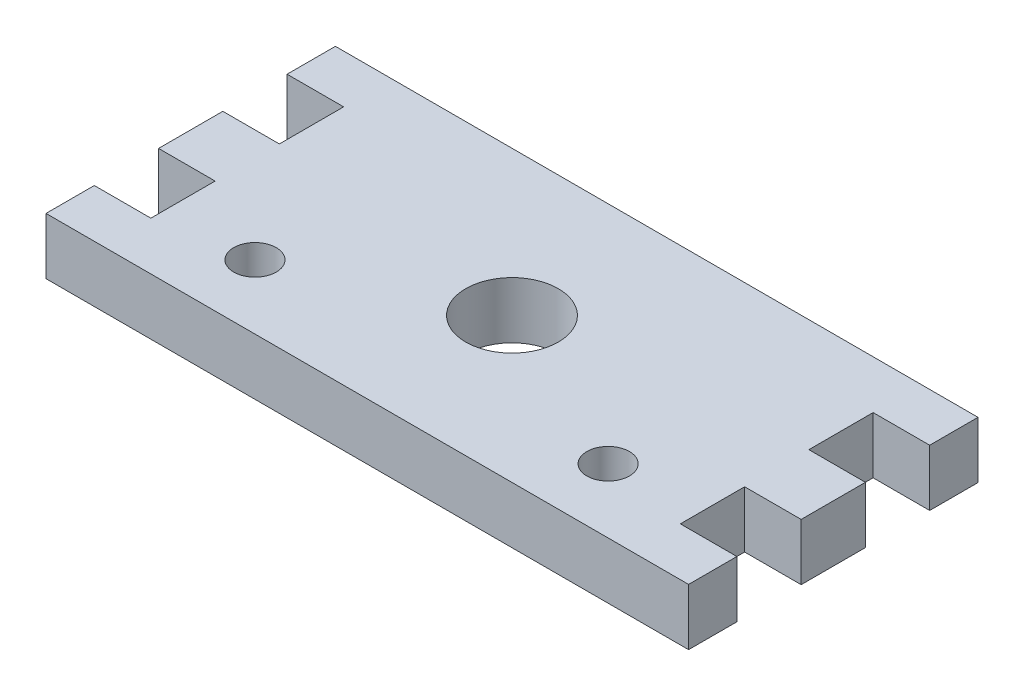
ISO-10303-21;
HEADER;
FILE_DESCRIPTION(('STEP AP214'),'2;1');
FILE_NAME('part.step','',(''),(''),'','','');
FILE_SCHEMA(('AUTOMOTIVE_DESIGN { 1 0 10303 214 1 1 1 1 }'));
ENDSEC;
DATA;
#1=APPLICATION_CONTEXT('core data for automotive mechanical design processes');
#2=APPLICATION_PROTOCOL_DEFINITION('international standard','automotive_design',2000,#1);
#3=PRODUCT_CONTEXT('',#1,'mechanical');
#4=PRODUCT('Part','Part','',(#3));
#5=PRODUCT_RELATED_PRODUCT_CATEGORY('part','',(#4));
#6=PRODUCT_DEFINITION_FORMATION('','',#4);
#7=PRODUCT_DEFINITION_CONTEXT('part definition',#1,'design');
#8=PRODUCT_DEFINITION('design','',#6,#7);
#9=PRODUCT_DEFINITION_SHAPE('','',#8);
#10=(LENGTH_UNIT() NAMED_UNIT(*) SI_UNIT(.MILLI.,.METRE.));
#11=(NAMED_UNIT(*) PLANE_ANGLE_UNIT() SI_UNIT($,.RADIAN.));
#12=(NAMED_UNIT(*) SI_UNIT($,.STERADIAN.) SOLID_ANGLE_UNIT());
#13=UNCERTAINTY_MEASURE_WITH_UNIT(LENGTH_MEASURE(1.E-05),#10,'distance_accuracy_value','');
#14=(GEOMETRIC_REPRESENTATION_CONTEXT(3) GLOBAL_UNCERTAINTY_ASSIGNED_CONTEXT((#13)) GLOBAL_UNIT_ASSIGNED_CONTEXT((#10,
#11,#12)) REPRESENTATION_CONTEXT('',''));
#15=CARTESIAN_POINT('',(0.,0.,0.));
#16=DIRECTION('',(0.,0.,1.));
#17=DIRECTION('',(1.,0.,0.));
#18=AXIS2_PLACEMENT_3D('',#15,#16,#17);
#19=CARTESIAN_POINT('',(0.,5.588,0.));
#20=DIRECTION('',(0.,-1.,0.));
#21=DIRECTION('',(0.,0.,-1.));
#22=AXIS2_PLACEMENT_3D('',#19,#20,#21);
#23=PLANE('',#22);
#24=DIRECTION('',(0.,0.,1.));
#25=VECTOR('',#24,1.);
#26=CARTESIAN_POINT('',(0.,5.588,0.));
#27=LINE('',#26,#25);
#28=CARTESIAN_POINT('',(0.,5.588,-4.775));
#29=VERTEX_POINT('',#28);
#30=CARTESIAN_POINT('',(0.,5.588,0.));
#31=VERTEX_POINT('',#30);
#32=EDGE_CURVE('E241',#29,#31,#27,.T.);
#33=ORIENTED_EDGE('',*,*,#32,.T.);
#34=DIRECTION('',(1.,0.,0.));
#35=VECTOR('',#34,1.);
#36=CARTESIAN_POINT('',(0.,5.588,0.));
#37=LINE('',#36,#35);
#38=CARTESIAN_POINT('',(63.5,5.588,0.));
#39=VERTEX_POINT('',#38);
#40=EDGE_CURVE('E129',#31,#39,#37,.T.);
#41=ORIENTED_EDGE('',*,*,#40,.T.);
#42=DIRECTION('',(0.,0.,-1.));
#43=VECTOR('',#42,1.);
#44=CARTESIAN_POINT('',(63.5,5.588,0.));
#45=LINE('',#44,#43);
#46=CARTESIAN_POINT('',(63.5,5.588,-4.77500000000002));
#47=VERTEX_POINT('',#46);
#48=EDGE_CURVE('E292',#39,#47,#45,.T.);
#49=ORIENTED_EDGE('',*,*,#48,.T.);
#50=DIRECTION('',(-1.,0.,0.));
#51=VECTOR('',#50,1.);
#52=CARTESIAN_POINT('',(63.5,5.588,-4.77500000000002));
#53=LINE('',#52,#51);
#54=CARTESIAN_POINT('',(57.912,5.588,-4.77500000000002));
#55=VERTEX_POINT('',#54);
#56=EDGE_CURVE('E311',#47,#55,#53,.T.);
#57=ORIENTED_EDGE('',*,*,#56,.T.);
#58=DIRECTION('',(0.,0.,-1.));
#59=VECTOR('',#58,1.);
#60=CARTESIAN_POINT('',(57.912,5.588,-4.77500000000002));
#61=LINE('',#60,#59);
#62=CARTESIAN_POINT('',(57.912,5.588,-11.125));
#63=VERTEX_POINT('',#62);
#64=EDGE_CURVE('E308',#55,#63,#61,.T.);
#65=ORIENTED_EDGE('',*,*,#64,.T.);
#66=DIRECTION('',(1.,0.,0.));
#67=VECTOR('',#66,1.);
#68=CARTESIAN_POINT('',(63.5,5.588,-11.125));
#69=LINE('',#68,#67);
#70=CARTESIAN_POINT('',(63.5,5.588,-11.125));
#71=VERTEX_POINT('',#70);
#72=EDGE_CURVE('E310',#63,#71,#69,.T.);
#73=ORIENTED_EDGE('',*,*,#72,.T.);
#74=DIRECTION('',(0.,0.,-1.));
#75=VECTOR('',#74,1.);
#76=CARTESIAN_POINT('',(63.5,5.588,-11.125));
#77=LINE('',#76,#75);
#78=CARTESIAN_POINT('',(63.5,5.588,-17.475));
#79=VERTEX_POINT('',#78);
#80=EDGE_CURVE('E313',#71,#79,#77,.T.);
#81=ORIENTED_EDGE('',*,*,#80,.T.);
#82=DIRECTION('',(-1.,0.,0.));
#83=VECTOR('',#82,1.);
#84=CARTESIAN_POINT('',(63.5,5.588,-17.475));
#85=LINE('',#84,#83);
#86=CARTESIAN_POINT('',(57.912,5.588,-17.475));
#87=VERTEX_POINT('',#86);
#88=EDGE_CURVE('E319',#79,#87,#85,.T.);
#89=ORIENTED_EDGE('',*,*,#88,.T.);
#90=DIRECTION('',(0.,0.,-1.));
#91=VECTOR('',#90,1.);
#92=CARTESIAN_POINT('',(57.912,5.588,-23.825));
#93=LINE('',#92,#91);
#94=CARTESIAN_POINT('',(57.912,5.588,-23.825));
#95=VERTEX_POINT('',#94);
#96=EDGE_CURVE('E321',#87,#95,#93,.T.);
#97=ORIENTED_EDGE('',*,*,#96,.T.);
#98=DIRECTION('',(1.,0.,0.));
#99=VECTOR('',#98,1.);
#100=CARTESIAN_POINT('',(63.5,5.588,-23.825));
#101=LINE('',#100,#99);
#102=CARTESIAN_POINT('',(63.5,5.588,-23.825));
#103=VERTEX_POINT('',#102);
#104=EDGE_CURVE('E323',#95,#103,#101,.T.);
#105=ORIENTED_EDGE('',*,*,#104,.T.);
#106=DIRECTION('',(0.,0.,-1.));
#107=VECTOR('',#106,1.);
#108=CARTESIAN_POINT('',(63.5,5.588,-23.825));
#109=LINE('',#108,#107);
#110=CARTESIAN_POINT('',(63.5,5.588,-28.6));
#111=VERTEX_POINT('',#110);
#112=EDGE_CURVE('E325',#103,#111,#109,.T.);
#113=ORIENTED_EDGE('',*,*,#112,.T.);
#114=DIRECTION('',(-1.,0.,0.));
#115=VECTOR('',#114,1.);
#116=CARTESIAN_POINT('',(0.,5.588,-28.6));
#117=LINE('',#116,#115);
#118=CARTESIAN_POINT('',(0.,5.588,-28.6));
#119=VERTEX_POINT('',#118);
#120=EDGE_CURVE('E327',#111,#119,#117,.T.);
#121=ORIENTED_EDGE('',*,*,#120,.T.);
#122=DIRECTION('',(0.,0.,1.));
#123=VECTOR('',#122,1.);
#124=CARTESIAN_POINT('',(0.,5.588,-23.825));
#125=LINE('',#124,#123);
#126=CARTESIAN_POINT('',(0.,5.588,-23.825));
#127=VERTEX_POINT('',#126);
#128=EDGE_CURVE('E329',#119,#127,#125,.T.);
#129=ORIENTED_EDGE('',*,*,#128,.T.);
#130=DIRECTION('',(1.,0.,0.));
#131=VECTOR('',#130,1.);
#132=CARTESIAN_POINT('',(0.,5.588,-23.825));
#133=LINE('',#132,#131);
#134=CARTESIAN_POINT('',(5.588,5.588,-23.825));
#135=VERTEX_POINT('',#134);
#136=EDGE_CURVE('E331',#127,#135,#133,.T.);
#137=ORIENTED_EDGE('',*,*,#136,.T.);
#138=DIRECTION('',(0.,0.,1.));
#139=VECTOR('',#138,1.);
#140=CARTESIAN_POINT('',(5.588,5.588,-23.825));
#141=LINE('',#140,#139);
#142=CARTESIAN_POINT('',(5.58800000000001,5.588,-17.475));
#143=VERTEX_POINT('',#142);
#144=EDGE_CURVE('E333',#135,#143,#141,.T.);
#145=ORIENTED_EDGE('',*,*,#144,.T.);
#146=DIRECTION('',(-1.,0.,0.));
#147=VECTOR('',#146,1.);
#148=CARTESIAN_POINT('',(0.,5.588,-17.475));
#149=LINE('',#148,#147);
#150=CARTESIAN_POINT('',(0.,5.588,-17.475));
#151=VERTEX_POINT('',#150);
#152=EDGE_CURVE('E335',#143,#151,#149,.T.);
#153=ORIENTED_EDGE('',*,*,#152,.T.);
#154=DIRECTION('',(0.,0.,1.));
#155=VECTOR('',#154,1.);
#156=CARTESIAN_POINT('',(0.,5.588,-11.125));
#157=LINE('',#156,#155);
#158=CARTESIAN_POINT('',(0.,5.588,-11.125));
#159=VERTEX_POINT('',#158);
#160=EDGE_CURVE('E184',#151,#159,#157,.T.);
#161=ORIENTED_EDGE('',*,*,#160,.T.);
#162=DIRECTION('',(1.,0.,0.));
#163=VECTOR('',#162,1.);
#164=CARTESIAN_POINT('',(0.,5.588,-11.125));
#165=LINE('',#164,#163);
#166=CARTESIAN_POINT('',(5.58800000000001,5.588,-11.125));
#167=VERTEX_POINT('',#166);
#168=EDGE_CURVE('E178',#159,#167,#165,.T.);
#169=ORIENTED_EDGE('',*,*,#168,.T.);
#170=DIRECTION('',(0.,0.,1.));
#171=VECTOR('',#170,1.);
#172=CARTESIAN_POINT('',(5.588,5.588,-4.775));
#173=LINE('',#172,#171);
#174=CARTESIAN_POINT('',(5.588,5.588,-4.775));
#175=VERTEX_POINT('',#174);
#176=EDGE_CURVE('E182',#167,#175,#173,.T.);
#177=ORIENTED_EDGE('',*,*,#176,.T.);
#178=DIRECTION('',(-1.,0.,0.));
#179=VECTOR('',#178,1.);
#180=CARTESIAN_POINT('',(0.,5.588,-4.775));
#181=LINE('',#180,#179);
#182=EDGE_CURVE('E50',#175,#29,#181,.T.);
#183=ORIENTED_EDGE('',*,*,#182,.T.);
#184=EDGE_LOOP('',(#33,#41,#49,#57,#65,#73,#81,#89,#97,#105,#113,#121,#129,#137,#145,#153,#161,
#169,#177,#183));
#185=FACE_BOUND('',#184,.T.);
#186=CARTESIAN_POINT('',(31.75,5.588,-14.3));
#187=DIRECTION('',(0.,1.,0.));
#188=DIRECTION('',(0.,0.,1.));
#189=AXIS2_PLACEMENT_3D('',#186,#187,#188);
#190=CIRCLE('',#189,4.57499999999999);
#191=CARTESIAN_POINT('',(31.75,5.588,-9.72500000000001));
#192=VERTEX_POINT('',#191);
#193=EDGE_CURVE('E206',#192,#192,#190,.T.);
#194=ORIENTED_EDGE('',*,*,#193,.F.);
#195=EDGE_LOOP('',(#194));
#196=FACE_BOUND('',#195,.T.);
#197=CARTESIAN_POINT('',(14.3,5.588,-6.35));
#198=DIRECTION('',(0.,1.,0.));
#199=DIRECTION('',(0.,0.,1.));
#200=AXIS2_PLACEMENT_3D('',#197,#198,#199);
#201=CIRCLE('',#200,2.1);
#202=CARTESIAN_POINT('',(14.3,5.588,-4.25));
#203=VERTEX_POINT('',#202);
#204=EDGE_CURVE('E389',#203,#203,#201,.T.);
#205=ORIENTED_EDGE('',*,*,#204,.F.);
#206=EDGE_LOOP('',(#205));
#207=FACE_BOUND('',#206,.T.);
#208=CARTESIAN_POINT('',(49.2,5.588,-6.35000000000001));
#209=DIRECTION('',(0.,1.,0.));
#210=DIRECTION('',(0.,0.,1.));
#211=AXIS2_PLACEMENT_3D('',#208,#209,#210);
#212=CIRCLE('',#211,2.1);
#213=CARTESIAN_POINT('',(49.2,5.588,-4.25000000000001));
#214=VERTEX_POINT('',#213);
#215=EDGE_CURVE('E380',#214,#214,#212,.T.);
#216=ORIENTED_EDGE('',*,*,#215,.F.);
#217=EDGE_LOOP('',(#216));
#218=FACE_BOUND('',#217,.T.);
#219=ADVANCED_FACE('F33',(#185,#196,#207,#218),#23,.F.);
#220=CARTESIAN_POINT('',(0.,0.,0.));
#221=DIRECTION('',(0.,-1.,0.));
#222=DIRECTION('',(0.,0.,-1.));
#223=AXIS2_PLACEMENT_3D('',#220,#221,#222);
#224=PLANE('',#223);
#225=CARTESIAN_POINT('',(14.3,0.,-6.35));
#226=DIRECTION('',(0.,1.,0.));
#227=DIRECTION('',(0.,0.,1.));
#228=AXIS2_PLACEMENT_3D('',#225,#226,#227);
#229=CIRCLE('',#228,2.1);
#230=CARTESIAN_POINT('',(14.3,0.,-4.25));
#231=VERTEX_POINT('',#230);
#232=EDGE_CURVE('E386',#231,#231,#229,.T.);
#233=ORIENTED_EDGE('',*,*,#232,.T.);
#234=EDGE_LOOP('',(#233));
#235=FACE_BOUND('',#234,.T.);
#236=DIRECTION('',(0.,0.,1.));
#237=VECTOR('',#236,1.);
#238=CARTESIAN_POINT('',(0.,0.,0.));
#239=LINE('',#238,#237);
#240=CARTESIAN_POINT('',(0.,0.,-4.775));
#241=VERTEX_POINT('',#240);
#242=CARTESIAN_POINT('',(0.,0.,0.));
#243=VERTEX_POINT('',#242);
#244=EDGE_CURVE('E202',#241,#243,#239,.T.);
#245=ORIENTED_EDGE('',*,*,#244,.F.);
#246=DIRECTION('',(-1.,0.,0.));
#247=VECTOR('',#246,1.);
#248=CARTESIAN_POINT('',(0.,0.,-4.775));
#249=LINE('',#248,#247);
#250=CARTESIAN_POINT('',(5.588,0.,-4.775));
#251=VERTEX_POINT('',#250);
#252=EDGE_CURVE('E121',#251,#241,#249,.T.);
#253=ORIENTED_EDGE('',*,*,#252,.F.);
#254=DIRECTION('',(0.,0.,1.));
#255=VECTOR('',#254,1.);
#256=CARTESIAN_POINT('',(5.588,0.,-4.775));
#257=LINE('',#256,#255);
#258=CARTESIAN_POINT('',(5.58800000000001,0.,-11.125));
#259=VERTEX_POINT('',#258);
#260=EDGE_CURVE('E115',#259,#251,#257,.T.);
#261=ORIENTED_EDGE('',*,*,#260,.F.);
#262=DIRECTION('',(1.,0.,0.));
#263=VECTOR('',#262,1.);
#264=CARTESIAN_POINT('',(0.,0.,-11.125));
#265=LINE('',#264,#263);
#266=CARTESIAN_POINT('',(0.,0.,-11.125));
#267=VERTEX_POINT('',#266);
#268=EDGE_CURVE('E192',#267,#259,#265,.T.);
#269=ORIENTED_EDGE('',*,*,#268,.F.);
#270=DIRECTION('',(0.,0.,1.));
#271=VECTOR('',#270,1.);
#272=CARTESIAN_POINT('',(0.,0.,-11.125));
#273=LINE('',#272,#271);
#274=CARTESIAN_POINT('',(0.,0.,-17.475));
#275=VERTEX_POINT('',#274);
#276=EDGE_CURVE('E236',#275,#267,#273,.T.);
#277=ORIENTED_EDGE('',*,*,#276,.F.);
#278=DIRECTION('',(-1.,0.,0.));
#279=VECTOR('',#278,1.);
#280=CARTESIAN_POINT('',(0.,0.,-17.475));
#281=LINE('',#280,#279);
#282=CARTESIAN_POINT('',(5.58800000000001,0.,-17.475));
#283=VERTEX_POINT('',#282);
#284=EDGE_CURVE('E234',#283,#275,#281,.T.);
#285=ORIENTED_EDGE('',*,*,#284,.F.);
#286=DIRECTION('',(0.,0.,1.));
#287=VECTOR('',#286,1.);
#288=CARTESIAN_POINT('',(5.588,0.,-23.825));
#289=LINE('',#288,#287);
#290=CARTESIAN_POINT('',(5.588,0.,-23.825));
#291=VERTEX_POINT('',#290);
#292=EDGE_CURVE('E232',#291,#283,#289,.T.);
#293=ORIENTED_EDGE('',*,*,#292,.F.);
#294=DIRECTION('',(1.,0.,0.));
#295=VECTOR('',#294,1.);
#296=CARTESIAN_POINT('',(0.,0.,-23.825));
#297=LINE('',#296,#295);
#298=CARTESIAN_POINT('',(0.,0.,-23.825));
#299=VERTEX_POINT('',#298);
#300=EDGE_CURVE('E230',#299,#291,#297,.T.);
#301=ORIENTED_EDGE('',*,*,#300,.F.);
#302=DIRECTION('',(0.,0.,1.));
#303=VECTOR('',#302,1.);
#304=CARTESIAN_POINT('',(0.,0.,-23.825));
#305=LINE('',#304,#303);
#306=CARTESIAN_POINT('',(0.,0.,-28.6));
#307=VERTEX_POINT('',#306);
#308=EDGE_CURVE('E228',#307,#299,#305,.T.);
#309=ORIENTED_EDGE('',*,*,#308,.F.);
#310=DIRECTION('',(-1.,0.,0.));
#311=VECTOR('',#310,1.);
#312=CARTESIAN_POINT('',(0.,0.,-28.6));
#313=LINE('',#312,#311);
#314=CARTESIAN_POINT('',(63.5,0.,-28.6));
#315=VERTEX_POINT('',#314);
#316=EDGE_CURVE('E226',#315,#307,#313,.T.);
#317=ORIENTED_EDGE('',*,*,#316,.F.);
#318=DIRECTION('',(0.,0.,-1.));
#319=VECTOR('',#318,1.);
#320=CARTESIAN_POINT('',(63.5,0.,-23.825));
#321=LINE('',#320,#319);
#322=CARTESIAN_POINT('',(63.5,0.,-23.825));
#323=VERTEX_POINT('',#322);
#324=EDGE_CURVE('E224',#323,#315,#321,.T.);
#325=ORIENTED_EDGE('',*,*,#324,.F.);
#326=DIRECTION('',(1.,0.,0.));
#327=VECTOR('',#326,1.);
#328=CARTESIAN_POINT('',(63.5,0.,-23.825));
#329=LINE('',#328,#327);
#330=CARTESIAN_POINT('',(57.912,0.,-23.825));
#331=VERTEX_POINT('',#330);
#332=EDGE_CURVE('E222',#331,#323,#329,.T.);
#333=ORIENTED_EDGE('',*,*,#332,.F.);
#334=DIRECTION('',(0.,0.,-1.));
#335=VECTOR('',#334,1.);
#336=CARTESIAN_POINT('',(57.912,0.,-23.825));
#337=LINE('',#336,#335);
#338=CARTESIAN_POINT('',(57.912,0.,-17.475));
#339=VERTEX_POINT('',#338);
#340=EDGE_CURVE('E220',#339,#331,#337,.T.);
#341=ORIENTED_EDGE('',*,*,#340,.F.);
#342=DIRECTION('',(-1.,0.,0.));
#343=VECTOR('',#342,1.);
#344=CARTESIAN_POINT('',(63.5,0.,-17.475));
#345=LINE('',#344,#343);
#346=CARTESIAN_POINT('',(63.5,0.,-17.475));
#347=VERTEX_POINT('',#346);
#348=EDGE_CURVE('E218',#347,#339,#345,.T.);
#349=ORIENTED_EDGE('',*,*,#348,.F.);
#350=DIRECTION('',(0.,0.,-1.));
#351=VECTOR('',#350,1.);
#352=CARTESIAN_POINT('',(63.5,0.,-11.125));
#353=LINE('',#352,#351);
#354=CARTESIAN_POINT('',(63.5,0.,-11.125));
#355=VERTEX_POINT('',#354);
#356=EDGE_CURVE('E216',#355,#347,#353,.T.);
#357=ORIENTED_EDGE('',*,*,#356,.F.);
#358=DIRECTION('',(1.,0.,0.));
#359=VECTOR('',#358,1.);
#360=CARTESIAN_POINT('',(63.5,0.,-11.125));
#361=LINE('',#360,#359);
#362=CARTESIAN_POINT('',(57.912,0.,-11.125));
#363=VERTEX_POINT('',#362);
#364=EDGE_CURVE('E214',#363,#355,#361,.T.);
#365=ORIENTED_EDGE('',*,*,#364,.F.);
#366=DIRECTION('',(0.,0.,-1.));
#367=VECTOR('',#366,1.);
#368=CARTESIAN_POINT('',(57.912,0.,-4.77500000000002));
#369=LINE('',#368,#367);
#370=CARTESIAN_POINT('',(57.912,0.,-4.77500000000002));
#371=VERTEX_POINT('',#370);
#372=EDGE_CURVE('E212',#371,#363,#369,.T.);
#373=ORIENTED_EDGE('',*,*,#372,.F.);
#374=DIRECTION('',(-1.,0.,0.));
#375=VECTOR('',#374,1.);
#376=CARTESIAN_POINT('',(63.5,0.,-4.77500000000002));
#377=LINE('',#376,#375);
#378=CARTESIAN_POINT('',(63.5,0.,-4.77500000000002));
#379=VERTEX_POINT('',#378);
#380=EDGE_CURVE('E210',#379,#371,#377,.T.);
#381=ORIENTED_EDGE('',*,*,#380,.F.);
#382=DIRECTION('',(0.,0.,-1.));
#383=VECTOR('',#382,1.);
#384=CARTESIAN_POINT('',(63.5,0.,0.));
#385=LINE('',#384,#383);
#386=CARTESIAN_POINT('',(63.5,0.,0.));
#387=VERTEX_POINT('',#386);
#388=EDGE_CURVE('E208',#387,#379,#385,.T.);
#389=ORIENTED_EDGE('',*,*,#388,.F.);
#390=DIRECTION('',(1.,0.,0.));
#391=VECTOR('',#390,1.);
#392=CARTESIAN_POINT('',(0.,0.,0.));
#393=LINE('',#392,#391);
#394=EDGE_CURVE('E205',#243,#387,#393,.T.);
#395=ORIENTED_EDGE('',*,*,#394,.F.);
#396=EDGE_LOOP('',(#245,#253,#261,#269,#277,#285,#293,#301,#309,#317,#325,#333,#341,#349,#357,
#365,#373,#381,#389,#395));
#397=FACE_BOUND('',#396,.T.);
#398=CARTESIAN_POINT('',(31.75,0.,-14.3));
#399=DIRECTION('',(0.,1.,0.));
#400=DIRECTION('',(0.,0.,1.));
#401=AXIS2_PLACEMENT_3D('',#398,#399,#400);
#402=CIRCLE('',#401,4.57499999999999);
#403=CARTESIAN_POINT('',(31.75,0.,-9.72500000000001));
#404=VERTEX_POINT('',#403);
#405=EDGE_CURVE('E392',#404,#404,#402,.T.);
#406=ORIENTED_EDGE('',*,*,#405,.T.);
#407=EDGE_LOOP('',(#406));
#408=FACE_BOUND('',#407,.T.);
#409=CARTESIAN_POINT('',(49.2,0.,-6.35000000000001));
#410=DIRECTION('',(0.,1.,0.));
#411=DIRECTION('',(0.,0.,1.));
#412=AXIS2_PLACEMENT_3D('',#409,#410,#411);
#413=CIRCLE('',#412,2.1);
#414=CARTESIAN_POINT('',(49.2,0.,-4.25000000000001));
#415=VERTEX_POINT('',#414);
#416=EDGE_CURVE('E383',#415,#415,#413,.T.);
#417=ORIENTED_EDGE('',*,*,#416,.T.);
#418=EDGE_LOOP('',(#417));
#419=FACE_BOUND('',#418,.T.);
#420=ADVANCED_FACE('F296',(#235,#397,#408,#419),#224,.T.);
#421=CARTESIAN_POINT('',(0.,5.588,0.));
#422=DIRECTION('',(1.,0.,0.));
#423=DIRECTION('',(0.,0.,-1.));
#424=AXIS2_PLACEMENT_3D('',#421,#422,#423);
#425=PLANE('',#424);
#426=ORIENTED_EDGE('',*,*,#244,.T.);
#427=DIRECTION('',(0.,-1.,0.));
#428=VECTOR('',#427,1.);
#429=CARTESIAN_POINT('',(0.,5.588,0.));
#430=LINE('',#429,#428);
#431=EDGE_CURVE('E11',#31,#243,#430,.T.);
#432=ORIENTED_EDGE('',*,*,#431,.F.);
#433=ORIENTED_EDGE('',*,*,#32,.F.);
#434=DIRECTION('',(0.,-1.,0.));
#435=VECTOR('',#434,1.);
#436=CARTESIAN_POINT('',(0.,5.588,-4.775));
#437=LINE('',#436,#435);
#438=EDGE_CURVE('E198',#29,#241,#437,.T.);
#439=ORIENTED_EDGE('',*,*,#438,.T.);
#440=EDGE_LOOP('',(#426,#432,#433,#439));
#441=FACE_BOUND('',#440,.T.);
#442=ADVANCED_FACE('F35',(#441),#425,.F.);
#443=CARTESIAN_POINT('',(0.,5.588,0.));
#444=DIRECTION('',(0.,0.,-1.));
#445=DIRECTION('',(-1.,0.,0.));
#446=AXIS2_PLACEMENT_3D('',#443,#444,#445);
#447=PLANE('',#446);
#448=ORIENTED_EDGE('',*,*,#394,.T.);
#449=DIRECTION('',(0.,-1.,0.));
#450=VECTOR('',#449,1.);
#451=CARTESIAN_POINT('',(63.5,5.588,0.));
#452=LINE('',#451,#450);
#453=EDGE_CURVE('E42',#39,#387,#452,.T.);
#454=ORIENTED_EDGE('',*,*,#453,.F.);
#455=ORIENTED_EDGE('',*,*,#40,.F.);
#456=ORIENTED_EDGE('',*,*,#431,.T.);
#457=EDGE_LOOP('',(#448,#454,#455,#456));
#458=FACE_BOUND('',#457,.T.);
#459=ADVANCED_FACE('F575',(#458),#447,.F.);
#460=CARTESIAN_POINT('',(63.5,5.588,0.));
#461=DIRECTION('',(-1.,0.,0.));
#462=DIRECTION('',(0.,0.,1.));
#463=AXIS2_PLACEMENT_3D('',#460,#461,#462);
#464=PLANE('',#463);
#465=ORIENTED_EDGE('',*,*,#388,.T.);
#466=DIRECTION('',(0.,-1.,0.));
#467=VECTOR('',#466,1.);
#468=CARTESIAN_POINT('',(63.5,5.588,-4.77500000000002));
#469=LINE('',#468,#467);
#470=EDGE_CURVE('E284',#47,#379,#469,.T.);
#471=ORIENTED_EDGE('',*,*,#470,.F.);
#472=ORIENTED_EDGE('',*,*,#48,.F.);
#473=ORIENTED_EDGE('',*,*,#453,.T.);
#474=EDGE_LOOP('',(#465,#471,#472,#473));
#475=FACE_BOUND('',#474,.T.);
#476=ADVANCED_FACE('F290',(#475),#464,.F.);
#477=CARTESIAN_POINT('',(63.5,5.588,-4.77500000000002));
#478=DIRECTION('',(0.,0.,1.));
#479=DIRECTION('',(1.,0.,0.));
#480=AXIS2_PLACEMENT_3D('',#477,#478,#479);
#481=PLANE('',#480);
#482=ORIENTED_EDGE('',*,*,#380,.T.);
#483=DIRECTION('',(0.,-1.,0.));
#484=VECTOR('',#483,1.);
#485=CARTESIAN_POINT('',(57.912,5.588,-4.77500000000002));
#486=LINE('',#485,#484);
#487=EDGE_CURVE('E281',#55,#371,#486,.T.);
#488=ORIENTED_EDGE('',*,*,#487,.F.);
#489=ORIENTED_EDGE('',*,*,#56,.F.);
#490=ORIENTED_EDGE('',*,*,#470,.T.);
#491=EDGE_LOOP('',(#482,#488,#489,#490));
#492=FACE_BOUND('',#491,.T.);
#493=ADVANCED_FACE('F302',(#492),#481,.F.);
#494=CARTESIAN_POINT('',(57.912,5.588,-4.77500000000002));
#495=DIRECTION('',(-1.,0.,0.));
#496=DIRECTION('',(0.,0.,1.));
#497=AXIS2_PLACEMENT_3D('',#494,#495,#496);
#498=PLANE('',#497);
#499=ORIENTED_EDGE('',*,*,#372,.T.);
#500=DIRECTION('',(0.,-1.,0.));
#501=VECTOR('',#500,1.);
#502=CARTESIAN_POINT('',(57.912,5.588,-11.125));
#503=LINE('',#502,#501);
#504=EDGE_CURVE('E278',#63,#363,#503,.T.);
#505=ORIENTED_EDGE('',*,*,#504,.F.);
#506=ORIENTED_EDGE('',*,*,#64,.F.);
#507=ORIENTED_EDGE('',*,*,#487,.T.);
#508=EDGE_LOOP('',(#499,#505,#506,#507));
#509=FACE_BOUND('',#508,.T.);
#510=ADVANCED_FACE('F306',(#509),#498,.F.);
#511=CARTESIAN_POINT('',(63.5,5.588,-11.125));
#512=DIRECTION('',(0.,0.,-1.));
#513=DIRECTION('',(-1.,0.,0.));
#514=AXIS2_PLACEMENT_3D('',#511,#512,#513);
#515=PLANE('',#514);
#516=ORIENTED_EDGE('',*,*,#364,.T.);
#517=DIRECTION('',(0.,-1.,0.));
#518=VECTOR('',#517,1.);
#519=CARTESIAN_POINT('',(63.5,5.588,-11.125));
#520=LINE('',#519,#518);
#521=EDGE_CURVE('E275',#71,#355,#520,.T.);
#522=ORIENTED_EDGE('',*,*,#521,.F.);
#523=ORIENTED_EDGE('',*,*,#72,.F.);
#524=ORIENTED_EDGE('',*,*,#504,.T.);
#525=EDGE_LOOP('',(#516,#522,#523,#524));
#526=FACE_BOUND('',#525,.T.);
#527=ADVANCED_FACE('F540',(#526),#515,.F.);
#528=CARTESIAN_POINT('',(63.5,5.588,-11.125));
#529=DIRECTION('',(-1.,0.,0.));
#530=DIRECTION('',(0.,0.,1.));
#531=AXIS2_PLACEMENT_3D('',#528,#529,#530);
#532=PLANE('',#531);
#533=ORIENTED_EDGE('',*,*,#356,.T.);
#534=DIRECTION('',(0.,-1.,0.));
#535=VECTOR('',#534,1.);
#536=CARTESIAN_POINT('',(63.5,5.588,-17.475));
#537=LINE('',#536,#535);
#538=EDGE_CURVE('E272',#79,#347,#537,.T.);
#539=ORIENTED_EDGE('',*,*,#538,.F.);
#540=ORIENTED_EDGE('',*,*,#80,.F.);
#541=ORIENTED_EDGE('',*,*,#521,.T.);
#542=EDGE_LOOP('',(#533,#539,#540,#541));
#543=FACE_BOUND('',#542,.T.);
#544=ADVANCED_FACE('F530',(#543),#532,.F.);
#545=CARTESIAN_POINT('',(63.5,5.588,-17.475));
#546=DIRECTION('',(0.,0.,1.));
#547=DIRECTION('',(1.,0.,0.));
#548=AXIS2_PLACEMENT_3D('',#545,#546,#547);
#549=PLANE('',#548);
#550=ORIENTED_EDGE('',*,*,#348,.T.);
#551=DIRECTION('',(0.,-1.,0.));
#552=VECTOR('',#551,1.);
#553=CARTESIAN_POINT('',(57.912,5.588,-17.475));
#554=LINE('',#553,#552);
#555=EDGE_CURVE('E269',#87,#339,#554,.T.);
#556=ORIENTED_EDGE('',*,*,#555,.F.);
#557=ORIENTED_EDGE('',*,*,#88,.F.);
#558=ORIENTED_EDGE('',*,*,#538,.T.);
#559=EDGE_LOOP('',(#550,#556,#557,#558));
#560=FACE_BOUND('',#559,.T.);
#561=ADVANCED_FACE('F520',(#560),#549,.F.);
#562=CARTESIAN_POINT('',(57.912,5.588,-23.825));
#563=DIRECTION('',(-1.,0.,0.));
#564=DIRECTION('',(0.,0.,1.));
#565=AXIS2_PLACEMENT_3D('',#562,#563,#564);
#566=PLANE('',#565);
#567=ORIENTED_EDGE('',*,*,#340,.T.);
#568=DIRECTION('',(0.,-1.,0.));
#569=VECTOR('',#568,1.);
#570=CARTESIAN_POINT('',(57.912,5.588,-23.825));
#571=LINE('',#570,#569);
#572=EDGE_CURVE('E266',#95,#331,#571,.T.);
#573=ORIENTED_EDGE('',*,*,#572,.F.);
#574=ORIENTED_EDGE('',*,*,#96,.F.);
#575=ORIENTED_EDGE('',*,*,#555,.T.);
#576=EDGE_LOOP('',(#567,#573,#574,#575));
#577=FACE_BOUND('',#576,.T.);
#578=ADVANCED_FACE('F510',(#577),#566,.F.);
#579=CARTESIAN_POINT('',(63.5,5.588,-23.825));
#580=DIRECTION('',(0.,0.,-1.));
#581=DIRECTION('',(-1.,0.,0.));
#582=AXIS2_PLACEMENT_3D('',#579,#580,#581);
#583=PLANE('',#582);
#584=ORIENTED_EDGE('',*,*,#332,.T.);
#585=DIRECTION('',(0.,-1.,0.));
#586=VECTOR('',#585,1.);
#587=CARTESIAN_POINT('',(63.5,5.588,-23.825));
#588=LINE('',#587,#586);
#589=EDGE_CURVE('E263',#103,#323,#588,.T.);
#590=ORIENTED_EDGE('',*,*,#589,.F.);
#591=ORIENTED_EDGE('',*,*,#104,.F.);
#592=ORIENTED_EDGE('',*,*,#572,.T.);
#593=EDGE_LOOP('',(#584,#590,#591,#592));
#594=FACE_BOUND('',#593,.T.);
#595=ADVANCED_FACE('F500',(#594),#583,.F.);
#596=CARTESIAN_POINT('',(63.5,5.588,-23.825));
#597=DIRECTION('',(-1.,0.,0.));
#598=DIRECTION('',(0.,0.,1.));
#599=AXIS2_PLACEMENT_3D('',#596,#597,#598);
#600=PLANE('',#599);
#601=ORIENTED_EDGE('',*,*,#324,.T.);
#602=DIRECTION('',(0.,-1.,0.));
#603=VECTOR('',#602,1.);
#604=CARTESIAN_POINT('',(63.5,5.588,-28.6));
#605=LINE('',#604,#603);
#606=EDGE_CURVE('E260',#111,#315,#605,.T.);
#607=ORIENTED_EDGE('',*,*,#606,.F.);
#608=ORIENTED_EDGE('',*,*,#112,.F.);
#609=ORIENTED_EDGE('',*,*,#589,.T.);
#610=EDGE_LOOP('',(#601,#607,#608,#609));
#611=FACE_BOUND('',#610,.T.);
#612=ADVANCED_FACE('F490',(#611),#600,.F.);
#613=CARTESIAN_POINT('',(0.,5.588,-28.6));
#614=DIRECTION('',(0.,0.,1.));
#615=DIRECTION('',(1.,0.,0.));
#616=AXIS2_PLACEMENT_3D('',#613,#614,#615);
#617=PLANE('',#616);
#618=ORIENTED_EDGE('',*,*,#316,.T.);
#619=DIRECTION('',(0.,-1.,0.));
#620=VECTOR('',#619,1.);
#621=CARTESIAN_POINT('',(0.,5.588,-28.6));
#622=LINE('',#621,#620);
#623=EDGE_CURVE('E257',#119,#307,#622,.T.);
#624=ORIENTED_EDGE('',*,*,#623,.F.);
#625=ORIENTED_EDGE('',*,*,#120,.F.);
#626=ORIENTED_EDGE('',*,*,#606,.T.);
#627=EDGE_LOOP('',(#618,#624,#625,#626));
#628=FACE_BOUND('',#627,.T.);
#629=ADVANCED_FACE('F480',(#628),#617,.F.);
#630=CARTESIAN_POINT('',(0.,5.588,-23.825));
#631=DIRECTION('',(1.,0.,0.));
#632=DIRECTION('',(0.,0.,-1.));
#633=AXIS2_PLACEMENT_3D('',#630,#631,#632);
#634=PLANE('',#633);
#635=ORIENTED_EDGE('',*,*,#308,.T.);
#636=DIRECTION('',(0.,-1.,0.));
#637=VECTOR('',#636,1.);
#638=CARTESIAN_POINT('',(0.,5.588,-23.825));
#639=LINE('',#638,#637);
#640=EDGE_CURVE('E254',#127,#299,#639,.T.);
#641=ORIENTED_EDGE('',*,*,#640,.F.);
#642=ORIENTED_EDGE('',*,*,#128,.F.);
#643=ORIENTED_EDGE('',*,*,#623,.T.);
#644=EDGE_LOOP('',(#635,#641,#642,#643));
#645=FACE_BOUND('',#644,.T.);
#646=ADVANCED_FACE('F470',(#645),#634,.F.);
#647=CARTESIAN_POINT('',(0.,5.588,-23.825));
#648=DIRECTION('',(0.,0.,-1.));
#649=DIRECTION('',(-1.,0.,0.));
#650=AXIS2_PLACEMENT_3D('',#647,#648,#649);
#651=PLANE('',#650);
#652=ORIENTED_EDGE('',*,*,#300,.T.);
#653=DIRECTION('',(0.,-1.,0.));
#654=VECTOR('',#653,1.);
#655=CARTESIAN_POINT('',(5.588,5.588,-23.825));
#656=LINE('',#655,#654);
#657=EDGE_CURVE('E251',#135,#291,#656,.T.);
#658=ORIENTED_EDGE('',*,*,#657,.F.);
#659=ORIENTED_EDGE('',*,*,#136,.F.);
#660=ORIENTED_EDGE('',*,*,#640,.T.);
#661=EDGE_LOOP('',(#652,#658,#659,#660));
#662=FACE_BOUND('',#661,.T.);
#663=ADVANCED_FACE('F460',(#662),#651,.F.);
#664=CARTESIAN_POINT('',(5.588,5.588,-23.825));
#665=DIRECTION('',(1.,0.,0.));
#666=DIRECTION('',(0.,0.,-1.));
#667=AXIS2_PLACEMENT_3D('',#664,#665,#666);
#668=PLANE('',#667);
#669=ORIENTED_EDGE('',*,*,#292,.T.);
#670=DIRECTION('',(0.,-1.,0.));
#671=VECTOR('',#670,1.);
#672=CARTESIAN_POINT('',(5.58800000000001,5.588,-17.475));
#673=LINE('',#672,#671);
#674=EDGE_CURVE('E248',#143,#283,#673,.T.);
#675=ORIENTED_EDGE('',*,*,#674,.F.);
#676=ORIENTED_EDGE('',*,*,#144,.F.);
#677=ORIENTED_EDGE('',*,*,#657,.T.);
#678=EDGE_LOOP('',(#669,#675,#676,#677));
#679=FACE_BOUND('',#678,.T.);
#680=ADVANCED_FACE('F451',(#679),#668,.F.);
#681=CARTESIAN_POINT('',(0.,5.588,-17.475));
#682=DIRECTION('',(0.,0.,1.));
#683=DIRECTION('',(1.,0.,0.));
#684=AXIS2_PLACEMENT_3D('',#681,#682,#683);
#685=PLANE('',#684);
#686=ORIENTED_EDGE('',*,*,#284,.T.);
#687=DIRECTION('',(0.,-1.,0.));
#688=VECTOR('',#687,1.);
#689=CARTESIAN_POINT('',(0.,5.588,-17.475));
#690=LINE('',#689,#688);
#691=EDGE_CURVE('E245',#151,#275,#690,.T.);
#692=ORIENTED_EDGE('',*,*,#691,.F.);
#693=ORIENTED_EDGE('',*,*,#152,.F.);
#694=ORIENTED_EDGE('',*,*,#674,.T.);
#695=EDGE_LOOP('',(#686,#692,#693,#694));
#696=FACE_BOUND('',#695,.T.);
#697=ADVANCED_FACE('F341',(#696),#685,.F.);
#698=CARTESIAN_POINT('',(0.,5.588,-11.125));
#699=DIRECTION('',(1.,0.,0.));
#700=DIRECTION('',(0.,0.,-1.));
#701=AXIS2_PLACEMENT_3D('',#698,#699,#700);
#702=PLANE('',#701);
#703=ORIENTED_EDGE('',*,*,#276,.T.);
#704=DIRECTION('',(0.,-1.,0.));
#705=VECTOR('',#704,1.);
#706=CARTESIAN_POINT('',(0.,5.588,-11.125));
#707=LINE('',#706,#705);
#708=EDGE_CURVE('E193',#159,#267,#707,.T.);
#709=ORIENTED_EDGE('',*,*,#708,.F.);
#710=ORIENTED_EDGE('',*,*,#160,.F.);
#711=ORIENTED_EDGE('',*,*,#691,.T.);
#712=EDGE_LOOP('',(#703,#709,#710,#711));
#713=FACE_BOUND('',#712,.T.);
#714=ADVANCED_FACE('F345',(#713),#702,.F.);
#715=CARTESIAN_POINT('',(0.,5.588,-11.125));
#716=DIRECTION('',(0.,0.,-1.));
#717=DIRECTION('',(-1.,0.,0.));
#718=AXIS2_PLACEMENT_3D('',#715,#716,#717);
#719=PLANE('',#718);
#720=ORIENTED_EDGE('',*,*,#268,.T.);
#721=DIRECTION('',(0.,-1.,0.));
#722=VECTOR('',#721,1.);
#723=CARTESIAN_POINT('',(5.58800000000001,5.588,-11.125));
#724=LINE('',#723,#722);
#725=EDGE_CURVE('E189',#167,#259,#724,.T.);
#726=ORIENTED_EDGE('',*,*,#725,.F.);
#727=ORIENTED_EDGE('',*,*,#168,.F.);
#728=ORIENTED_EDGE('',*,*,#708,.T.);
#729=EDGE_LOOP('',(#720,#726,#727,#728));
#730=FACE_BOUND('',#729,.T.);
#731=ADVANCED_FACE('F190',(#730),#719,.F.);
#732=CARTESIAN_POINT('',(5.588,5.588,-4.775));
#733=DIRECTION('',(1.,0.,0.));
#734=DIRECTION('',(0.,0.,-1.));
#735=AXIS2_PLACEMENT_3D('',#732,#733,#734);
#736=PLANE('',#735);
#737=ORIENTED_EDGE('',*,*,#260,.T.);
#738=DIRECTION('',(0.,-1.,0.));
#739=VECTOR('',#738,1.);
#740=CARTESIAN_POINT('',(5.588,5.588,-4.775));
#741=LINE('',#740,#739);
#742=EDGE_CURVE('E194',#175,#251,#741,.T.);
#743=ORIENTED_EDGE('',*,*,#742,.F.);
#744=ORIENTED_EDGE('',*,*,#176,.F.);
#745=ORIENTED_EDGE('',*,*,#725,.T.);
#746=EDGE_LOOP('',(#737,#743,#744,#745));
#747=FACE_BOUND('',#746,.T.);
#748=ADVANCED_FACE('F196',(#747),#736,.F.);
#749=CARTESIAN_POINT('',(0.,5.588,-4.775));
#750=DIRECTION('',(0.,0.,1.));
#751=DIRECTION('',(1.,0.,0.));
#752=AXIS2_PLACEMENT_3D('',#749,#750,#751);
#753=PLANE('',#752);
#754=ORIENTED_EDGE('',*,*,#252,.T.);
#755=ORIENTED_EDGE('',*,*,#438,.F.);
#756=ORIENTED_EDGE('',*,*,#182,.F.);
#757=ORIENTED_EDGE('',*,*,#742,.T.);
#758=EDGE_LOOP('',(#754,#755,#756,#757));
#759=FACE_BOUND('',#758,.T.);
#760=ADVANCED_FACE('F349',(#759),#753,.F.);
#761=CARTESIAN_POINT('',(31.75,5.588,-14.3));
#762=DIRECTION('',(0.,-1.,0.));
#763=DIRECTION('',(0.,0.,-1.));
#764=AXIS2_PLACEMENT_3D('',#761,#762,#763);
#765=CYLINDRICAL_SURFACE('',#764,4.57499999999999);
#766=ORIENTED_EDGE('',*,*,#193,.T.);
#767=EDGE_LOOP('',(#766));
#768=FACE_BOUND('',#767,.T.);
#769=ORIENTED_EDGE('',*,*,#405,.F.);
#770=EDGE_LOOP('',(#769));
#771=FACE_BOUND('',#770,.T.);
#772=ADVANCED_FACE('F351',(#768,#771),#765,.F.);
#773=CARTESIAN_POINT('',(14.3,5.588,-6.35));
#774=DIRECTION('',(0.,-1.,0.));
#775=DIRECTION('',(0.,0.,-1.));
#776=AXIS2_PLACEMENT_3D('',#773,#774,#775);
#777=CYLINDRICAL_SURFACE('',#776,2.1);
#778=ORIENTED_EDGE('',*,*,#204,.T.);
#779=EDGE_LOOP('',(#778));
#780=FACE_BOUND('',#779,.T.);
#781=ORIENTED_EDGE('',*,*,#232,.F.);
#782=EDGE_LOOP('',(#781));
#783=FACE_BOUND('',#782,.T.);
#784=ADVANCED_FACE('F357',(#780,#783),#777,.F.);
#785=CARTESIAN_POINT('',(49.2,5.588,-6.35000000000001));
#786=DIRECTION('',(0.,-1.,0.));
#787=DIRECTION('',(0.,0.,-1.));
#788=AXIS2_PLACEMENT_3D('',#785,#786,#787);
#789=CYLINDRICAL_SURFACE('',#788,2.1);
#790=ORIENTED_EDGE('',*,*,#215,.T.);
#791=EDGE_LOOP('',(#790));
#792=FACE_BOUND('',#791,.T.);
#793=ORIENTED_EDGE('',*,*,#416,.F.);
#794=EDGE_LOOP('',(#793));
#795=FACE_BOUND('',#794,.T.);
#796=ADVANCED_FACE('F371',(#792,#795),#789,.F.);
#797=CLOSED_SHELL('',(#219,#420,#442,#459,#476,#493,#510,#527,#544,#561,#578,#595,#612,#629,
#646,#663,#680,#697,#714,#731,#748,#760,#772,#784,#796));
#798=MANIFOLD_SOLID_BREP('B2',#797);
#799=ADVANCED_BREP_SHAPE_REPRESENTATION('',(#18,#798),#14);
#800=SHAPE_DEFINITION_REPRESENTATION(#9,#799);
ENDSEC;
END-ISO-10303-21;
